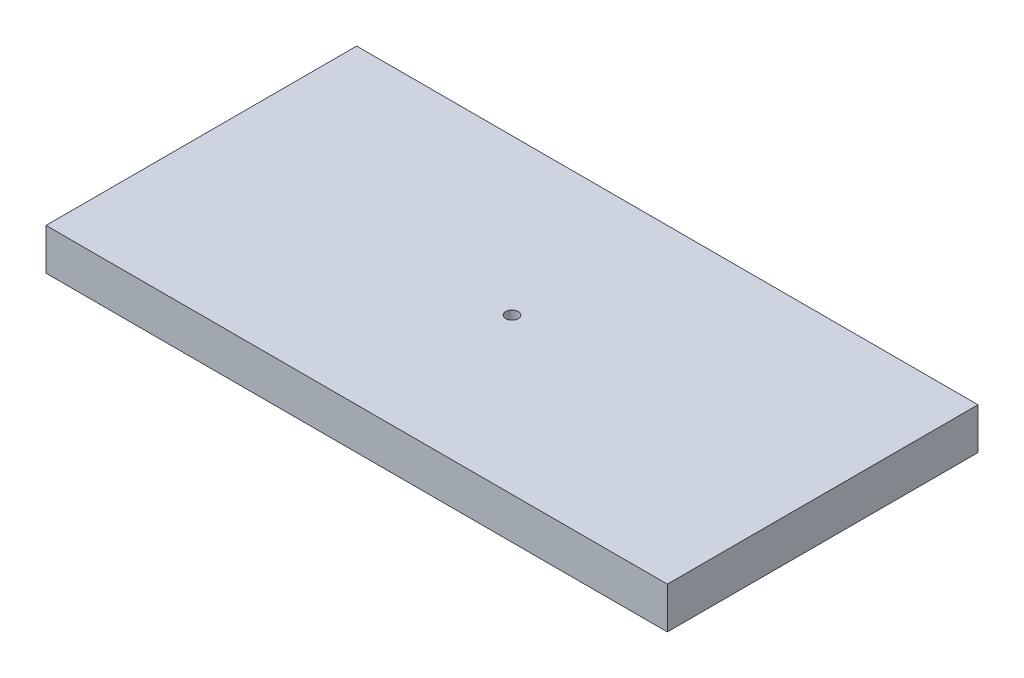
ISO-10303-21;
HEADER;
FILE_DESCRIPTION(('STEP AP214'),'2;1');
FILE_NAME('part.step','',(''),(''),'','','');
FILE_SCHEMA(('AUTOMOTIVE_DESIGN { 1 0 10303 214 1 1 1 1 }'));
ENDSEC;
DATA;
#1=APPLICATION_CONTEXT('core data for automotive mechanical design processes');
#2=APPLICATION_PROTOCOL_DEFINITION('international standard','automotive_design',2000,#1);
#3=PRODUCT_CONTEXT('',#1,'mechanical');
#4=PRODUCT('Part','Part','',(#3));
#5=PRODUCT_RELATED_PRODUCT_CATEGORY('part','',(#4));
#6=PRODUCT_DEFINITION_FORMATION('','',#4);
#7=PRODUCT_DEFINITION_CONTEXT('part definition',#1,'design');
#8=PRODUCT_DEFINITION('design','',#6,#7);
#9=PRODUCT_DEFINITION_SHAPE('','',#8);
#10=(LENGTH_UNIT() NAMED_UNIT(*) SI_UNIT(.MILLI.,.METRE.));
#11=(NAMED_UNIT(*) PLANE_ANGLE_UNIT() SI_UNIT($,.RADIAN.));
#12=(NAMED_UNIT(*) SI_UNIT($,.STERADIAN.) SOLID_ANGLE_UNIT());
#13=UNCERTAINTY_MEASURE_WITH_UNIT(LENGTH_MEASURE(1.E-05),#10,'distance_accuracy_value','');
#14=(GEOMETRIC_REPRESENTATION_CONTEXT(3) GLOBAL_UNCERTAINTY_ASSIGNED_CONTEXT((#13)) GLOBAL_UNIT_ASSIGNED_CONTEXT((#10,
#11,#12)) REPRESENTATION_CONTEXT('',''));
#15=CARTESIAN_POINT('',(0.,0.,0.));
#16=DIRECTION('',(0.,0.,1.));
#17=DIRECTION('',(1.,0.,0.));
#18=AXIS2_PLACEMENT_3D('',#15,#16,#17);
#19=CARTESIAN_POINT('',(150.,20.,75.));
#20=DIRECTION('',(-1.,0.,0.));
#21=DIRECTION('',(0.,0.,1.));
#22=AXIS2_PLACEMENT_3D('',#19,#20,#21);
#23=PLANE('',#22);
#24=DIRECTION('',(0.,0.,-1.));
#25=VECTOR('',#24,1.);
#26=CARTESIAN_POINT('',(150.,0.,75.));
#27=LINE('',#26,#25);
#28=CARTESIAN_POINT('',(150.,0.,75.));
#29=VERTEX_POINT('',#28);
#30=CARTESIAN_POINT('',(150.,0.,-75.));
#31=VERTEX_POINT('',#30);
#32=EDGE_CURVE('E99',#29,#31,#27,.T.);
#33=ORIENTED_EDGE('',*,*,#32,.T.);
#34=DIRECTION('',(0.,-1.,0.));
#35=VECTOR('',#34,1.);
#36=CARTESIAN_POINT('',(150.,20.,-75.));
#37=LINE('',#36,#35);
#38=CARTESIAN_POINT('',(150.,20.,-75.));
#39=VERTEX_POINT('',#38);
#40=EDGE_CURVE('E11',#39,#31,#37,.T.);
#41=ORIENTED_EDGE('',*,*,#40,.F.);
#42=DIRECTION('',(0.,0.,-1.));
#43=VECTOR('',#42,1.);
#44=CARTESIAN_POINT('',(150.,20.,75.));
#45=LINE('',#44,#43);
#46=CARTESIAN_POINT('',(150.,20.,75.));
#47=VERTEX_POINT('',#46);
#48=EDGE_CURVE('E87',#47,#39,#45,.T.);
#49=ORIENTED_EDGE('',*,*,#48,.F.);
#50=DIRECTION('',(0.,-1.,0.));
#51=VECTOR('',#50,1.);
#52=CARTESIAN_POINT('',(150.,20.,75.));
#53=LINE('',#52,#51);
#54=EDGE_CURVE('E95',#47,#29,#53,.T.);
#55=ORIENTED_EDGE('',*,*,#54,.T.);
#56=EDGE_LOOP('',(#33,#41,#49,#55));
#57=FACE_BOUND('',#56,.T.);
#58=ADVANCED_FACE('F36',(#57),#23,.F.);
#59=CARTESIAN_POINT('',(-150.,20.,-75.));
#60=DIRECTION('',(0.,0.,1.));
#61=DIRECTION('',(1.,0.,0.));
#62=AXIS2_PLACEMENT_3D('',#59,#60,#61);
#63=PLANE('',#62);
#64=DIRECTION('',(-1.,0.,0.));
#65=VECTOR('',#64,1.);
#66=CARTESIAN_POINT('',(-150.,0.,-75.));
#67=LINE('',#66,#65);
#68=CARTESIAN_POINT('',(-150.,0.,-75.));
#69=VERTEX_POINT('',#68);
#70=EDGE_CURVE('E91',#31,#69,#67,.T.);
#71=ORIENTED_EDGE('',*,*,#70,.T.);
#72=DIRECTION('',(0.,-1.,0.));
#73=VECTOR('',#72,1.);
#74=CARTESIAN_POINT('',(-150.,20.,-75.));
#75=LINE('',#74,#73);
#76=CARTESIAN_POINT('',(-150.,20.,-75.));
#77=VERTEX_POINT('',#76);
#78=EDGE_CURVE('E44',#77,#69,#75,.T.);
#79=ORIENTED_EDGE('',*,*,#78,.F.);
#80=DIRECTION('',(-1.,0.,0.));
#81=VECTOR('',#80,1.);
#82=CARTESIAN_POINT('',(-150.,20.,-75.));
#83=LINE('',#82,#81);
#84=EDGE_CURVE('E82',#39,#77,#83,.T.);
#85=ORIENTED_EDGE('',*,*,#84,.F.);
#86=ORIENTED_EDGE('',*,*,#40,.T.);
#87=EDGE_LOOP('',(#71,#79,#85,#86));
#88=FACE_BOUND('',#87,.T.);
#89=ADVANCED_FACE('F90',(#88),#63,.F.);
#90=CARTESIAN_POINT('',(-150.,20.,75.));
#91=DIRECTION('',(1.,0.,0.));
#92=DIRECTION('',(0.,0.,-1.));
#93=AXIS2_PLACEMENT_3D('',#90,#91,#92);
#94=PLANE('',#93);
#95=DIRECTION('',(0.,0.,1.));
#96=VECTOR('',#95,1.);
#97=CARTESIAN_POINT('',(-150.,0.,75.));
#98=LINE('',#97,#96);
#99=CARTESIAN_POINT('',(-150.,0.,75.));
#100=VERTEX_POINT('',#99);
#101=EDGE_CURVE('E69',#69,#100,#98,.T.);
#102=ORIENTED_EDGE('',*,*,#101,.T.);
#103=DIRECTION('',(0.,-1.,0.));
#104=VECTOR('',#103,1.);
#105=CARTESIAN_POINT('',(-150.,20.,75.));
#106=LINE('',#105,#104);
#107=CARTESIAN_POINT('',(-150.,20.,75.));
#108=VERTEX_POINT('',#107);
#109=EDGE_CURVE('E92',#108,#100,#106,.T.);
#110=ORIENTED_EDGE('',*,*,#109,.F.);
#111=DIRECTION('',(0.,0.,1.));
#112=VECTOR('',#111,1.);
#113=CARTESIAN_POINT('',(-150.,20.,75.));
#114=LINE('',#113,#112);
#115=EDGE_CURVE('E85',#77,#108,#114,.T.);
#116=ORIENTED_EDGE('',*,*,#115,.F.);
#117=ORIENTED_EDGE('',*,*,#78,.T.);
#118=EDGE_LOOP('',(#102,#110,#116,#117));
#119=FACE_BOUND('',#118,.T.);
#120=ADVANCED_FACE('F93',(#119),#94,.F.);
#121=CARTESIAN_POINT('',(-150.,20.,75.));
#122=DIRECTION('',(0.,0.,-1.));
#123=DIRECTION('',(-1.,0.,0.));
#124=AXIS2_PLACEMENT_3D('',#121,#122,#123);
#125=PLANE('',#124);
#126=DIRECTION('',(1.,0.,0.));
#127=VECTOR('',#126,1.);
#128=CARTESIAN_POINT('',(-150.,0.,75.));
#129=LINE('',#128,#127);
#130=EDGE_CURVE('E75',#100,#29,#129,.T.);
#131=ORIENTED_EDGE('',*,*,#130,.T.);
#132=ORIENTED_EDGE('',*,*,#54,.F.);
#133=DIRECTION('',(1.,0.,0.));
#134=VECTOR('',#133,1.);
#135=CARTESIAN_POINT('',(-150.,20.,75.));
#136=LINE('',#135,#134);
#137=EDGE_CURVE('E52',#108,#47,#136,.T.);
#138=ORIENTED_EDGE('',*,*,#137,.F.);
#139=ORIENTED_EDGE('',*,*,#109,.T.);
#140=EDGE_LOOP('',(#131,#132,#138,#139));
#141=FACE_BOUND('',#140,.T.);
#142=ADVANCED_FACE('F107',(#141),#125,.F.);
#143=CARTESIAN_POINT('',(0.,20.,0.));
#144=DIRECTION('',(0.,-1.,0.));
#145=DIRECTION('',(0.,0.,-1.));
#146=AXIS2_PLACEMENT_3D('',#143,#144,#145);
#147=PLANE('',#146);
#148=CARTESIAN_POINT('',(0.,20.,0.));
#149=DIRECTION('',(0.,1.,0.));
#150=DIRECTION('',(0.,0.,1.));
#151=AXIS2_PLACEMENT_3D('',#148,#149,#150);
#152=CIRCLE('',#151,3.);
#153=CARTESIAN_POINT('',(0.,20.,3.));
#154=VERTEX_POINT('',#153);
#155=EDGE_CURVE('E113',#154,#154,#152,.T.);
#156=ORIENTED_EDGE('',*,*,#155,.F.);
#157=EDGE_LOOP('',(#156));
#158=FACE_BOUND('',#157,.T.);
#159=ORIENTED_EDGE('',*,*,#48,.T.);
#160=ORIENTED_EDGE('',*,*,#84,.T.);
#161=ORIENTED_EDGE('',*,*,#115,.T.);
#162=ORIENTED_EDGE('',*,*,#137,.T.);
#163=EDGE_LOOP('',(#159,#160,#161,#162));
#164=FACE_BOUND('',#163,.T.);
#165=ADVANCED_FACE('F83',(#158,#164),#147,.F.);
#166=CARTESIAN_POINT('',(0.,0.,0.));
#167=DIRECTION('',(0.,-1.,0.));
#168=DIRECTION('',(0.,0.,-1.));
#169=AXIS2_PLACEMENT_3D('',#166,#167,#168);
#170=PLANE('',#169);
#171=ORIENTED_EDGE('',*,*,#32,.F.);
#172=ORIENTED_EDGE('',*,*,#130,.F.);
#173=ORIENTED_EDGE('',*,*,#101,.F.);
#174=ORIENTED_EDGE('',*,*,#70,.F.);
#175=EDGE_LOOP('',(#171,#172,#173,#174));
#176=FACE_BOUND('',#175,.T.);
#177=ADVANCED_FACE('F110',(#176),#170,.T.);
#178=CARTESIAN_POINT('',(0.,10.,0.));
#179=DIRECTION('',(0.,1.,0.));
#180=DIRECTION('',(0.,0.,1.));
#181=AXIS2_PLACEMENT_3D('',#178,#179,#180);
#182=CYLINDRICAL_SURFACE('',#181,3.);
#183=CARTESIAN_POINT('',(0.,10.,0.));
#184=DIRECTION('',(0.,1.,0.));
#185=DIRECTION('',(0.,0.,1.));
#186=AXIS2_PLACEMENT_3D('',#183,#184,#185);
#187=CIRCLE('',#186,3.);
#188=CARTESIAN_POINT('',(0.,10.,3.));
#189=VERTEX_POINT('',#188);
#190=EDGE_CURVE('E102',#189,#189,#187,.T.);
#191=ORIENTED_EDGE('',*,*,#190,.F.);
#192=EDGE_LOOP('',(#191));
#193=FACE_BOUND('',#192,.T.);
#194=ORIENTED_EDGE('',*,*,#155,.T.);
#195=EDGE_LOOP('',(#194));
#196=FACE_BOUND('',#195,.T.);
#197=ADVANCED_FACE('F121',(#193,#196),#182,.F.);
#198=CARTESIAN_POINT('',(0.,10.,0.));
#199=DIRECTION('',(0.,1.,0.));
#200=DIRECTION('',(0.,0.,1.));
#201=AXIS2_PLACEMENT_3D('',#198,#199,#200);
#202=PLANE('',#201);
#203=ORIENTED_EDGE('',*,*,#190,.T.);
#204=EDGE_LOOP('',(#203));
#205=FACE_BOUND('',#204,.T.);
#206=ADVANCED_FACE('F119',(#205),#202,.T.);
#207=CLOSED_SHELL('',(#58,#89,#120,#142,#165,#177,#197,#206));
#208=MANIFOLD_SOLID_BREP('B2',#207);
#209=ADVANCED_BREP_SHAPE_REPRESENTATION('',(#18,#208),#14);
#210=SHAPE_DEFINITION_REPRESENTATION(#9,#209);
ENDSEC;
END-ISO-10303-21;
